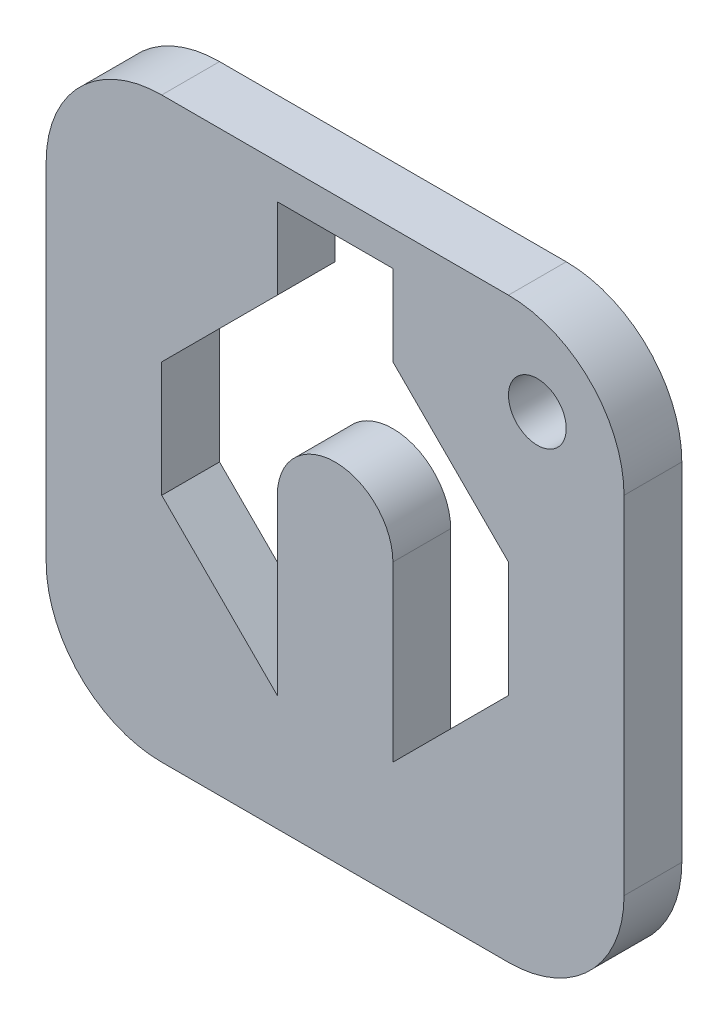
ISO-10303-21;
HEADER;
FILE_DESCRIPTION(('STEP AP214'),'2;1');
FILE_NAME('part.step','',(''),(''),'','','');
FILE_SCHEMA(('AUTOMOTIVE_DESIGN { 1 0 10303 214 1 1 1 1 }'));
ENDSEC;
DATA;
#1=APPLICATION_CONTEXT('core data for automotive mechanical design processes');
#2=APPLICATION_PROTOCOL_DEFINITION('international standard','automotive_design',2000,#1);
#3=PRODUCT_CONTEXT('',#1,'mechanical');
#4=PRODUCT('Part','Part','',(#3));
#5=PRODUCT_RELATED_PRODUCT_CATEGORY('part','',(#4));
#6=PRODUCT_DEFINITION_FORMATION('','',#4);
#7=PRODUCT_DEFINITION_CONTEXT('part definition',#1,'design');
#8=PRODUCT_DEFINITION('design','',#6,#7);
#9=PRODUCT_DEFINITION_SHAPE('','',#8);
#10=(LENGTH_UNIT() NAMED_UNIT(*) SI_UNIT(.MILLI.,.METRE.));
#11=(NAMED_UNIT(*) PLANE_ANGLE_UNIT() SI_UNIT($,.RADIAN.));
#12=(NAMED_UNIT(*) SI_UNIT($,.STERADIAN.) SOLID_ANGLE_UNIT());
#13=UNCERTAINTY_MEASURE_WITH_UNIT(LENGTH_MEASURE(1.E-05),#10,'distance_accuracy_value','');
#14=(GEOMETRIC_REPRESENTATION_CONTEXT(3) GLOBAL_UNCERTAINTY_ASSIGNED_CONTEXT((#13)) GLOBAL_UNIT_ASSIGNED_CONTEXT((#10,
#11,#12)) REPRESENTATION_CONTEXT('',''));
#15=CARTESIAN_POINT('',(0.,0.,0.));
#16=DIRECTION('',(0.,0.,1.));
#17=DIRECTION('',(1.,0.,0.));
#18=AXIS2_PLACEMENT_3D('',#15,#16,#17);
#19=CARTESIAN_POINT('',(-25.,25.,5.));
#20=DIRECTION('',(1.,0.,0.));
#21=DIRECTION('',(0.,1.,0.));
#22=AXIS2_PLACEMENT_3D('',#19,#20,#21);
#23=PLANE('',#22);
#24=DIRECTION('',(0.,-1.,0.));
#25=VECTOR('',#24,1.);
#26=CARTESIAN_POINT('',(-25.,25.,5.));
#27=LINE('',#26,#25);
#28=CARTESIAN_POINT('',(-25.,15.,5.));
#29=VERTEX_POINT('',#28);
#30=CARTESIAN_POINT('',(-25.,-15.,5.));
#31=VERTEX_POINT('',#30);
#32=EDGE_CURVE('E277',#29,#31,#27,.T.);
#33=ORIENTED_EDGE('',*,*,#32,.F.);
#34=DIRECTION('',(0.,0.,-1.));
#35=VECTOR('',#34,1.);
#36=CARTESIAN_POINT('',(-25.,15.,5.));
#37=LINE('',#36,#35);
#38=CARTESIAN_POINT('',(-25.,15.,0.));
#39=VERTEX_POINT('',#38);
#40=EDGE_CURVE('E11',#29,#39,#37,.T.);
#41=ORIENTED_EDGE('',*,*,#40,.T.);
#42=DIRECTION('',(0.,-1.,0.));
#43=VECTOR('',#42,1.);
#44=CARTESIAN_POINT('',(-25.,25.,0.));
#45=LINE('',#44,#43);
#46=CARTESIAN_POINT('',(-25.,-15.,0.));
#47=VERTEX_POINT('',#46);
#48=EDGE_CURVE('E274',#39,#47,#45,.T.);
#49=ORIENTED_EDGE('',*,*,#48,.T.);
#50=DIRECTION('',(0.,0.,-1.));
#51=VECTOR('',#50,1.);
#52=CARTESIAN_POINT('',(-25.,-15.,5.));
#53=LINE('',#52,#51);
#54=EDGE_CURVE('E41',#47,#31,#53,.F.);
#55=ORIENTED_EDGE('',*,*,#54,.T.);
#56=EDGE_LOOP('',(#33,#41,#49,#55));
#57=FACE_BOUND('',#56,.T.);
#58=ADVANCED_FACE('F33',(#57),#23,.F.);
#59=CARTESIAN_POINT('',(-25.,-25.,5.));
#60=DIRECTION('',(0.,1.,0.));
#61=DIRECTION('',(0.,0.,1.));
#62=AXIS2_PLACEMENT_3D('',#59,#60,#61);
#63=PLANE('',#62);
#64=DIRECTION('',(1.,0.,0.));
#65=VECTOR('',#64,1.);
#66=CARTESIAN_POINT('',(-25.,-25.,0.));
#67=LINE('',#66,#65);
#68=CARTESIAN_POINT('',(-15.,-25.,0.));
#69=VERTEX_POINT('',#68);
#70=CARTESIAN_POINT('',(15.,-25.,0.));
#71=VERTEX_POINT('',#70);
#72=EDGE_CURVE('E293',#69,#71,#67,.T.);
#73=ORIENTED_EDGE('',*,*,#72,.T.);
#74=DIRECTION('',(0.,0.,-1.));
#75=VECTOR('',#74,1.);
#76=CARTESIAN_POINT('',(15.,-25.,5.));
#77=LINE('',#76,#75);
#78=CARTESIAN_POINT('',(15.,-25.,5.));
#79=VERTEX_POINT('',#78);
#80=EDGE_CURVE('E329',#71,#79,#77,.F.);
#81=ORIENTED_EDGE('',*,*,#80,.T.);
#82=DIRECTION('',(1.,0.,0.));
#83=VECTOR('',#82,1.);
#84=CARTESIAN_POINT('',(-25.,-25.,5.));
#85=LINE('',#84,#83);
#86=CARTESIAN_POINT('',(-15.,-25.,5.));
#87=VERTEX_POINT('',#86);
#88=EDGE_CURVE('E280',#87,#79,#85,.T.);
#89=ORIENTED_EDGE('',*,*,#88,.F.);
#90=DIRECTION('',(0.,0.,-1.));
#91=VECTOR('',#90,1.);
#92=CARTESIAN_POINT('',(-15.,-25.,5.));
#93=LINE('',#92,#91);
#94=EDGE_CURVE('E326',#87,#69,#93,.T.);
#95=ORIENTED_EDGE('',*,*,#94,.T.);
#96=EDGE_LOOP('',(#73,#81,#89,#95));
#97=FACE_BOUND('',#96,.T.);
#98=ADVANCED_FACE('F344',(#97),#63,.F.);
#99=CARTESIAN_POINT('',(25.,25.,5.));
#100=DIRECTION('',(-1.,0.,0.));
#101=DIRECTION('',(0.,-1.,0.));
#102=AXIS2_PLACEMENT_3D('',#99,#100,#101);
#103=PLANE('',#102);
#104=DIRECTION('',(0.,1.,0.));
#105=VECTOR('',#104,1.);
#106=CARTESIAN_POINT('',(25.,25.,0.));
#107=LINE('',#106,#105);
#108=CARTESIAN_POINT('',(25.,-15.,0.));
#109=VERTEX_POINT('',#108);
#110=CARTESIAN_POINT('',(25.,15.,0.));
#111=VERTEX_POINT('',#110);
#112=EDGE_CURVE('E296',#109,#111,#107,.T.);
#113=ORIENTED_EDGE('',*,*,#112,.T.);
#114=DIRECTION('',(0.,0.,-1.));
#115=VECTOR('',#114,1.);
#116=CARTESIAN_POINT('',(25.,15.,5.));
#117=LINE('',#116,#115);
#118=CARTESIAN_POINT('',(25.,15.,5.));
#119=VERTEX_POINT('',#118);
#120=EDGE_CURVE('E316',#111,#119,#117,.F.);
#121=ORIENTED_EDGE('',*,*,#120,.T.);
#122=DIRECTION('',(0.,1.,0.));
#123=VECTOR('',#122,1.);
#124=CARTESIAN_POINT('',(25.,25.,5.));
#125=LINE('',#124,#123);
#126=CARTESIAN_POINT('',(25.,-15.,5.));
#127=VERTEX_POINT('',#126);
#128=EDGE_CURVE('E284',#127,#119,#125,.T.);
#129=ORIENTED_EDGE('',*,*,#128,.F.);
#130=DIRECTION('',(0.,0.,-1.));
#131=VECTOR('',#130,1.);
#132=CARTESIAN_POINT('',(25.,-15.,5.));
#133=LINE('',#132,#131);
#134=EDGE_CURVE('E313',#127,#109,#133,.T.);
#135=ORIENTED_EDGE('',*,*,#134,.T.);
#136=EDGE_LOOP('',(#113,#121,#129,#135));
#137=FACE_BOUND('',#136,.T.);
#138=ADVANCED_FACE('F355',(#137),#103,.F.);
#139=CARTESIAN_POINT('',(-25.,25.,5.));
#140=DIRECTION('',(0.,-1.,0.));
#141=DIRECTION('',(0.,0.,-1.));
#142=AXIS2_PLACEMENT_3D('',#139,#140,#141);
#143=PLANE('',#142);
#144=DIRECTION('',(-1.,0.,0.));
#145=VECTOR('',#144,1.);
#146=CARTESIAN_POINT('',(-25.,25.,5.));
#147=LINE('',#146,#145);
#148=CARTESIAN_POINT('',(15.,25.,5.));
#149=VERTEX_POINT('',#148);
#150=CARTESIAN_POINT('',(-15.,25.,5.));
#151=VERTEX_POINT('',#150);
#152=EDGE_CURVE('E287',#149,#151,#147,.T.);
#153=ORIENTED_EDGE('',*,*,#152,.F.);
#154=DIRECTION('',(0.,0.,-1.));
#155=VECTOR('',#154,1.);
#156=CARTESIAN_POINT('',(15.,25.,5.));
#157=LINE('',#156,#155);
#158=CARTESIAN_POINT('',(15.,25.,0.));
#159=VERTEX_POINT('',#158);
#160=EDGE_CURVE('E302',#149,#159,#157,.T.);
#161=ORIENTED_EDGE('',*,*,#160,.T.);
#162=DIRECTION('',(-1.,0.,0.));
#163=VECTOR('',#162,1.);
#164=CARTESIAN_POINT('',(-25.,25.,0.));
#165=LINE('',#164,#163);
#166=CARTESIAN_POINT('',(-15.,25.,0.));
#167=VERTEX_POINT('',#166);
#168=EDGE_CURVE('E281',#159,#167,#165,.T.);
#169=ORIENTED_EDGE('',*,*,#168,.T.);
#170=DIRECTION('',(0.,0.,-1.));
#171=VECTOR('',#170,1.);
#172=CARTESIAN_POINT('',(-15.,25.,5.));
#173=LINE('',#172,#171);
#174=EDGE_CURVE('E290',#167,#151,#173,.F.);
#175=ORIENTED_EDGE('',*,*,#174,.T.);
#176=EDGE_LOOP('',(#153,#161,#169,#175));
#177=FACE_BOUND('',#176,.T.);
#178=ADVANCED_FACE('F363',(#177),#143,.F.);
#179=CARTESIAN_POINT('',(0.,0.,5.));
#180=DIRECTION('',(0.,0.,1.));
#181=DIRECTION('',(1.,0.,0.));
#182=AXIS2_PLACEMENT_3D('',#179,#180,#181);
#183=PLANE('',#182);
#184=CARTESIAN_POINT('',(0.,0.,5.));
#185=DIRECTION('',(0.,0.,-1.));
#186=DIRECTION('',(-1.,0.,0.));
#187=AXIS2_PLACEMENT_3D('',#184,#185,#186);
#188=CIRCLE('',#187,5.);
#189=CARTESIAN_POINT('',(-5.,0.,5.));
#190=VERTEX_POINT('',#189);
#191=CARTESIAN_POINT('',(5.,0.,5.));
#192=VERTEX_POINT('',#191);
#193=EDGE_CURVE('E48',#190,#192,#188,.T.);
#194=ORIENTED_EDGE('',*,*,#193,.F.);
#195=DIRECTION('',(0.,1.,0.));
#196=VECTOR('',#195,1.);
#197=CARTESIAN_POINT('',(-5.,0.,5.));
#198=LINE('',#197,#196);
#199=CARTESIAN_POINT('',(-5.,-15.,5.));
#200=VERTEX_POINT('',#199);
#201=EDGE_CURVE('E189',#200,#190,#198,.T.);
#202=ORIENTED_EDGE('',*,*,#201,.F.);
#203=DIRECTION('',(0.707106781186545,-0.70710678118655,0.));
#204=VECTOR('',#203,1.);
#205=CARTESIAN_POINT('',(-5.,-15.,5.));
#206=LINE('',#205,#204);
#207=CARTESIAN_POINT('',(-15.,-4.99999999999992,5.));
#208=VERTEX_POINT('',#207);
#209=EDGE_CURVE('E192',#208,#200,#206,.T.);
#210=ORIENTED_EDGE('',*,*,#209,.F.);
#211=DIRECTION('',(0.,-1.,0.));
#212=VECTOR('',#211,1.);
#213=CARTESIAN_POINT('',(-15.,-4.99999999999992,5.));
#214=LINE('',#213,#212);
#215=CARTESIAN_POINT('',(-15.,5.00000000000008,5.));
#216=VERTEX_POINT('',#215);
#217=EDGE_CURVE('E244',#216,#208,#214,.T.);
#218=ORIENTED_EDGE('',*,*,#217,.F.);
#219=DIRECTION('',(-0.70710678118655,-0.707106781186545,0.));
#220=VECTOR('',#219,1.);
#221=CARTESIAN_POINT('',(-15.,5.00000000000008,5.));
#222=LINE('',#221,#220);
#223=CARTESIAN_POINT('',(-4.99999999999992,15.0000000000001,5.));
#224=VERTEX_POINT('',#223);
#225=EDGE_CURVE('E241',#224,#216,#222,.T.);
#226=ORIENTED_EDGE('',*,*,#225,.F.);
#227=DIRECTION('',(0.,-1.,0.));
#228=VECTOR('',#227,1.);
#229=CARTESIAN_POINT('',(-4.99999999999992,15.0000000000001,5.));
#230=LINE('',#229,#228);
#231=CARTESIAN_POINT('',(-4.99999999999992,22.,5.));
#232=VERTEX_POINT('',#231);
#233=EDGE_CURVE('E238',#232,#224,#230,.T.);
#234=ORIENTED_EDGE('',*,*,#233,.F.);
#235=DIRECTION('',(-1.,0.,0.));
#236=VECTOR('',#235,1.);
#237=CARTESIAN_POINT('',(-4.99999999999992,22.,5.));
#238=LINE('',#237,#236);
#239=CARTESIAN_POINT('',(5.00000000000008,22.,5.));
#240=VERTEX_POINT('',#239);
#241=EDGE_CURVE('E235',#240,#232,#238,.T.);
#242=ORIENTED_EDGE('',*,*,#241,.F.);
#243=DIRECTION('',(0.,1.,0.));
#244=VECTOR('',#243,1.);
#245=CARTESIAN_POINT('',(5.00000000000008,22.,5.));
#246=LINE('',#245,#244);
#247=CARTESIAN_POINT('',(5.00000000000008,15.0000000000001,5.));
#248=VERTEX_POINT('',#247);
#249=EDGE_CURVE('E232',#248,#240,#246,.T.);
#250=ORIENTED_EDGE('',*,*,#249,.F.);
#251=DIRECTION('',(-0.707106781186545,0.70710678118655,0.));
#252=VECTOR('',#251,1.);
#253=CARTESIAN_POINT('',(5.00000000000008,15.0000000000001,5.));
#254=LINE('',#253,#252);
#255=CARTESIAN_POINT('',(15.,5.00000000000008,5.));
#256=VERTEX_POINT('',#255);
#257=EDGE_CURVE('E229',#256,#248,#254,.T.);
#258=ORIENTED_EDGE('',*,*,#257,.F.);
#259=DIRECTION('',(0.,1.,0.));
#260=VECTOR('',#259,1.);
#261=CARTESIAN_POINT('',(15.,5.00000000000008,5.));
#262=LINE('',#261,#260);
#263=CARTESIAN_POINT('',(15.,-5.00000000000006,5.));
#264=VERTEX_POINT('',#263);
#265=EDGE_CURVE('E226',#264,#256,#262,.T.);
#266=ORIENTED_EDGE('',*,*,#265,.F.);
#267=DIRECTION('',(0.70710678118655,0.707106781186545,0.));
#268=VECTOR('',#267,1.);
#269=CARTESIAN_POINT('',(15.,-5.00000000000006,5.));
#270=LINE('',#269,#268);
#271=CARTESIAN_POINT('',(5.,-15.,5.));
#272=VERTEX_POINT('',#271);
#273=EDGE_CURVE('E223',#272,#264,#270,.T.);
#274=ORIENTED_EDGE('',*,*,#273,.F.);
#275=DIRECTION('',(0.,-1.,0.));
#276=VECTOR('',#275,1.);
#277=CARTESIAN_POINT('',(5.,-15.,5.));
#278=LINE('',#277,#276);
#279=EDGE_CURVE('E221',#192,#272,#278,.T.);
#280=ORIENTED_EDGE('',*,*,#279,.F.);
#281=EDGE_LOOP('',(#194,#202,#210,#218,#226,#234,#242,#250,#258,#266,#274,#280));
#282=FACE_BOUND('',#281,.T.);
#283=CARTESIAN_POINT('',(17.5,17.5,5.));
#284=DIRECTION('',(0.,0.,1.));
#285=DIRECTION('',(1.,0.,0.));
#286=AXIS2_PLACEMENT_3D('',#283,#284,#285);
#287=CIRCLE('',#286,2.5);
#288=CARTESIAN_POINT('',(20.,17.5,5.));
#289=VERTEX_POINT('',#288);
#290=EDGE_CURVE('E251',#289,#289,#287,.T.);
#291=ORIENTED_EDGE('',*,*,#290,.F.);
#292=EDGE_LOOP('',(#291));
#293=FACE_BOUND('',#292,.T.);
#294=ORIENTED_EDGE('',*,*,#128,.T.);
#295=CARTESIAN_POINT('',(15.,15.,5.));
#296=DIRECTION('',(0.,0.,1.));
#297=DIRECTION('',(1.,0.,0.));
#298=AXIS2_PLACEMENT_3D('',#295,#296,#297);
#299=CIRCLE('',#298,9.99999999999997);
#300=EDGE_CURVE('E324',#119,#149,#299,.T.);
#301=ORIENTED_EDGE('',*,*,#300,.T.);
#302=ORIENTED_EDGE('',*,*,#152,.T.);
#303=CARTESIAN_POINT('',(-15.,15.,5.));
#304=DIRECTION('',(0.,0.,1.));
#305=DIRECTION('',(1.,0.,0.));
#306=AXIS2_PLACEMENT_3D('',#303,#304,#305);
#307=CIRCLE('',#306,9.99999999999997);
#308=EDGE_CURVE('E320',#151,#29,#307,.T.);
#309=ORIENTED_EDGE('',*,*,#308,.T.);
#310=ORIENTED_EDGE('',*,*,#32,.T.);
#311=CARTESIAN_POINT('',(-15.,-15.,5.));
#312=DIRECTION('',(0.,0.,1.));
#313=DIRECTION('',(1.,0.,0.));
#314=AXIS2_PLACEMENT_3D('',#311,#312,#313);
#315=CIRCLE('',#314,9.99999999999997);
#316=EDGE_CURVE('E318',#31,#87,#315,.T.);
#317=ORIENTED_EDGE('',*,*,#316,.T.);
#318=ORIENTED_EDGE('',*,*,#88,.T.);
#319=CARTESIAN_POINT('',(15.,-15.,5.));
#320=DIRECTION('',(0.,0.,1.));
#321=DIRECTION('',(1.,0.,0.));
#322=AXIS2_PLACEMENT_3D('',#319,#320,#321);
#323=CIRCLE('',#322,9.99999999999997);
#324=EDGE_CURVE('E322',#79,#127,#323,.T.);
#325=ORIENTED_EDGE('',*,*,#324,.T.);
#326=EDGE_LOOP('',(#294,#301,#302,#309,#310,#317,#318,#325));
#327=FACE_BOUND('',#326,.T.);
#328=ADVANCED_FACE('F338',(#282,#293,#327),#183,.T.);
#329=CARTESIAN_POINT('',(0.,0.,0.));
#330=DIRECTION('',(0.,0.,1.));
#331=DIRECTION('',(1.,0.,0.));
#332=AXIS2_PLACEMENT_3D('',#329,#330,#331);
#333=PLANE('',#332);
#334=DIRECTION('',(0.,1.,0.));
#335=VECTOR('',#334,1.);
#336=CARTESIAN_POINT('',(-5.,0.,0.));
#337=LINE('',#336,#335);
#338=CARTESIAN_POINT('',(-5.,-15.,0.));
#339=VERTEX_POINT('',#338);
#340=CARTESIAN_POINT('',(-5.,0.,0.));
#341=VERTEX_POINT('',#340);
#342=EDGE_CURVE('E178',#339,#341,#337,.T.);
#343=ORIENTED_EDGE('',*,*,#342,.T.);
#344=CARTESIAN_POINT('',(0.,0.,0.));
#345=DIRECTION('',(0.,0.,-1.));
#346=DIRECTION('',(-1.,0.,0.));
#347=AXIS2_PLACEMENT_3D('',#344,#345,#346);
#348=CIRCLE('',#347,5.);
#349=CARTESIAN_POINT('',(5.,0.,0.));
#350=VERTEX_POINT('',#349);
#351=EDGE_CURVE('E172',#341,#350,#348,.T.);
#352=ORIENTED_EDGE('',*,*,#351,.T.);
#353=DIRECTION('',(0.,-1.,0.));
#354=VECTOR('',#353,1.);
#355=CARTESIAN_POINT('',(5.,-15.,0.));
#356=LINE('',#355,#354);
#357=CARTESIAN_POINT('',(5.,-15.,0.));
#358=VERTEX_POINT('',#357);
#359=EDGE_CURVE('E181',#350,#358,#356,.T.);
#360=ORIENTED_EDGE('',*,*,#359,.T.);
#361=DIRECTION('',(0.70710678118655,0.707106781186545,0.));
#362=VECTOR('',#361,1.);
#363=CARTESIAN_POINT('',(15.,-5.00000000000006,0.));
#364=LINE('',#363,#362);
#365=CARTESIAN_POINT('',(15.,-5.00000000000006,0.));
#366=VERTEX_POINT('',#365);
#367=EDGE_CURVE('E56',#358,#366,#364,.T.);
#368=ORIENTED_EDGE('',*,*,#367,.T.);
#369=DIRECTION('',(0.,1.,0.));
#370=VECTOR('',#369,1.);
#371=CARTESIAN_POINT('',(15.,5.00000000000008,0.));
#372=LINE('',#371,#370);
#373=CARTESIAN_POINT('',(15.,5.00000000000008,0.));
#374=VERTEX_POINT('',#373);
#375=EDGE_CURVE('E196',#366,#374,#372,.T.);
#376=ORIENTED_EDGE('',*,*,#375,.T.);
#377=DIRECTION('',(-0.707106781186545,0.70710678118655,0.));
#378=VECTOR('',#377,1.);
#379=CARTESIAN_POINT('',(5.00000000000008,15.0000000000001,0.));
#380=LINE('',#379,#378);
#381=CARTESIAN_POINT('',(5.00000000000008,15.0000000000001,0.));
#382=VERTEX_POINT('',#381);
#383=EDGE_CURVE('E199',#374,#382,#380,.T.);
#384=ORIENTED_EDGE('',*,*,#383,.T.);
#385=DIRECTION('',(0.,1.,0.));
#386=VECTOR('',#385,1.);
#387=CARTESIAN_POINT('',(5.00000000000008,22.,0.));
#388=LINE('',#387,#386);
#389=CARTESIAN_POINT('',(5.00000000000008,22.,0.));
#390=VERTEX_POINT('',#389);
#391=EDGE_CURVE('E202',#382,#390,#388,.T.);
#392=ORIENTED_EDGE('',*,*,#391,.T.);
#393=DIRECTION('',(-1.,0.,0.));
#394=VECTOR('',#393,1.);
#395=CARTESIAN_POINT('',(-4.99999999999992,22.,0.));
#396=LINE('',#395,#394);
#397=CARTESIAN_POINT('',(-4.99999999999992,22.,0.));
#398=VERTEX_POINT('',#397);
#399=EDGE_CURVE('E205',#390,#398,#396,.T.);
#400=ORIENTED_EDGE('',*,*,#399,.T.);
#401=DIRECTION('',(0.,-1.,0.));
#402=VECTOR('',#401,1.);
#403=CARTESIAN_POINT('',(-4.99999999999992,15.0000000000001,0.));
#404=LINE('',#403,#402);
#405=CARTESIAN_POINT('',(-4.99999999999992,15.0000000000001,0.));
#406=VERTEX_POINT('',#405);
#407=EDGE_CURVE('E208',#398,#406,#404,.T.);
#408=ORIENTED_EDGE('',*,*,#407,.T.);
#409=DIRECTION('',(-0.70710678118655,-0.707106781186545,0.));
#410=VECTOR('',#409,1.);
#411=CARTESIAN_POINT('',(-15.,5.00000000000008,0.));
#412=LINE('',#411,#410);
#413=CARTESIAN_POINT('',(-15.,5.00000000000008,0.));
#414=VERTEX_POINT('',#413);
#415=EDGE_CURVE('E211',#406,#414,#412,.T.);
#416=ORIENTED_EDGE('',*,*,#415,.T.);
#417=DIRECTION('',(0.,-1.,0.));
#418=VECTOR('',#417,1.);
#419=CARTESIAN_POINT('',(-15.,-4.99999999999992,0.));
#420=LINE('',#419,#418);
#421=CARTESIAN_POINT('',(-15.,-4.99999999999992,0.));
#422=VERTEX_POINT('',#421);
#423=EDGE_CURVE('E214',#414,#422,#420,.T.);
#424=ORIENTED_EDGE('',*,*,#423,.T.);
#425=DIRECTION('',(0.707106781186545,-0.70710678118655,0.));
#426=VECTOR('',#425,1.);
#427=CARTESIAN_POINT('',(-5.,-15.,0.));
#428=LINE('',#427,#426);
#429=EDGE_CURVE('E217',#422,#339,#428,.T.);
#430=ORIENTED_EDGE('',*,*,#429,.T.);
#431=EDGE_LOOP('',(#343,#352,#360,#368,#376,#384,#392,#400,#408,#416,#424,#430));
#432=FACE_BOUND('',#431,.T.);
#433=CARTESIAN_POINT('',(17.5,17.5,0.));
#434=DIRECTION('',(0.,0.,1.));
#435=DIRECTION('',(1.,0.,0.));
#436=AXIS2_PLACEMENT_3D('',#433,#434,#435);
#437=CIRCLE('',#436,2.5);
#438=CARTESIAN_POINT('',(20.,17.5,0.));
#439=VERTEX_POINT('',#438);
#440=EDGE_CURVE('E271',#439,#439,#437,.T.);
#441=ORIENTED_EDGE('',*,*,#440,.T.);
#442=EDGE_LOOP('',(#441));
#443=FACE_BOUND('',#442,.T.);
#444=ORIENTED_EDGE('',*,*,#168,.F.);
#445=CARTESIAN_POINT('',(15.,15.,0.));
#446=DIRECTION('',(0.,0.,1.));
#447=DIRECTION('',(1.,0.,0.));
#448=AXIS2_PLACEMENT_3D('',#445,#446,#447);
#449=CIRCLE('',#448,9.99999999999997);
#450=EDGE_CURVE('E311',#159,#111,#449,.F.);
#451=ORIENTED_EDGE('',*,*,#450,.T.);
#452=ORIENTED_EDGE('',*,*,#112,.F.);
#453=CARTESIAN_POINT('',(15.,-15.,0.));
#454=DIRECTION('',(0.,0.,1.));
#455=DIRECTION('',(1.,0.,0.));
#456=AXIS2_PLACEMENT_3D('',#453,#454,#455);
#457=CIRCLE('',#456,9.99999999999997);
#458=EDGE_CURVE('E309',#109,#71,#457,.F.);
#459=ORIENTED_EDGE('',*,*,#458,.T.);
#460=ORIENTED_EDGE('',*,*,#72,.F.);
#461=CARTESIAN_POINT('',(-15.,-15.,0.));
#462=DIRECTION('',(0.,0.,1.));
#463=DIRECTION('',(1.,0.,0.));
#464=AXIS2_PLACEMENT_3D('',#461,#462,#463);
#465=CIRCLE('',#464,9.99999999999997);
#466=EDGE_CURVE('E305',#69,#47,#465,.F.);
#467=ORIENTED_EDGE('',*,*,#466,.T.);
#468=ORIENTED_EDGE('',*,*,#48,.F.);
#469=CARTESIAN_POINT('',(-15.,15.,0.));
#470=DIRECTION('',(0.,0.,1.));
#471=DIRECTION('',(1.,0.,0.));
#472=AXIS2_PLACEMENT_3D('',#469,#470,#471);
#473=CIRCLE('',#472,9.99999999999997);
#474=EDGE_CURVE('E307',#39,#167,#473,.F.);
#475=ORIENTED_EDGE('',*,*,#474,.T.);
#476=EDGE_LOOP('',(#444,#451,#452,#459,#460,#467,#468,#475));
#477=FACE_BOUND('',#476,.T.);
#478=ADVANCED_FACE('F185',(#432,#443,#477),#333,.F.);
#479=CARTESIAN_POINT('',(15.,15.,5.));
#480=DIRECTION('',(0.,0.,-1.));
#481=DIRECTION('',(-1.,0.,0.));
#482=AXIS2_PLACEMENT_3D('',#479,#480,#481);
#483=CYLINDRICAL_SURFACE('',#482,9.99999999999997);
#484=ORIENTED_EDGE('',*,*,#300,.F.);
#485=ORIENTED_EDGE('',*,*,#120,.F.);
#486=ORIENTED_EDGE('',*,*,#450,.F.);
#487=ORIENTED_EDGE('',*,*,#160,.F.);
#488=EDGE_LOOP('',(#484,#485,#486,#487));
#489=FACE_BOUND('',#488,.T.);
#490=ADVANCED_FACE('F361',(#489),#483,.T.);
#491=CARTESIAN_POINT('',(15.,-15.,5.));
#492=DIRECTION('',(0.,0.,-1.));
#493=DIRECTION('',(-1.,0.,0.));
#494=AXIS2_PLACEMENT_3D('',#491,#492,#493);
#495=CYLINDRICAL_SURFACE('',#494,9.99999999999997);
#496=ORIENTED_EDGE('',*,*,#324,.F.);
#497=ORIENTED_EDGE('',*,*,#80,.F.);
#498=ORIENTED_EDGE('',*,*,#458,.F.);
#499=ORIENTED_EDGE('',*,*,#134,.F.);
#500=EDGE_LOOP('',(#496,#497,#498,#499));
#501=FACE_BOUND('',#500,.T.);
#502=ADVANCED_FACE('F352',(#501),#495,.T.);
#503=CARTESIAN_POINT('',(-15.,15.,5.));
#504=DIRECTION('',(0.,0.,-1.));
#505=DIRECTION('',(-1.,0.,0.));
#506=AXIS2_PLACEMENT_3D('',#503,#504,#505);
#507=CYLINDRICAL_SURFACE('',#506,9.99999999999997);
#508=ORIENTED_EDGE('',*,*,#308,.F.);
#509=ORIENTED_EDGE('',*,*,#174,.F.);
#510=ORIENTED_EDGE('',*,*,#474,.F.);
#511=ORIENTED_EDGE('',*,*,#40,.F.);
#512=EDGE_LOOP('',(#508,#509,#510,#511));
#513=FACE_BOUND('',#512,.T.);
#514=ADVANCED_FACE('F366',(#513),#507,.T.);
#515=CARTESIAN_POINT('',(-15.,-15.,5.));
#516=DIRECTION('',(0.,0.,-1.));
#517=DIRECTION('',(-1.,0.,0.));
#518=AXIS2_PLACEMENT_3D('',#515,#516,#517);
#519=CYLINDRICAL_SURFACE('',#518,9.99999999999997);
#520=ORIENTED_EDGE('',*,*,#316,.F.);
#521=ORIENTED_EDGE('',*,*,#54,.F.);
#522=ORIENTED_EDGE('',*,*,#466,.F.);
#523=ORIENTED_EDGE('',*,*,#94,.F.);
#524=EDGE_LOOP('',(#520,#521,#522,#523));
#525=FACE_BOUND('',#524,.T.);
#526=ADVANCED_FACE('F35',(#525),#519,.T.);
#527=CARTESIAN_POINT('',(17.5,17.5,0.));
#528=DIRECTION('',(0.,0.,1.));
#529=DIRECTION('',(1.,0.,0.));
#530=AXIS2_PLACEMENT_3D('',#527,#528,#529);
#531=CYLINDRICAL_SURFACE('',#530,2.5);
#532=ORIENTED_EDGE('',*,*,#440,.F.);
#533=EDGE_LOOP('',(#532));
#534=FACE_BOUND('',#533,.T.);
#535=ORIENTED_EDGE('',*,*,#290,.T.);
#536=EDGE_LOOP('',(#535));
#537=FACE_BOUND('',#536,.T.);
#538=ADVANCED_FACE('F372',(#534,#537),#531,.F.);
#539=CARTESIAN_POINT('',(0.,0.,0.));
#540=DIRECTION('',(0.,0.,1.));
#541=DIRECTION('',(1.,0.,0.));
#542=AXIS2_PLACEMENT_3D('',#539,#540,#541);
#543=CYLINDRICAL_SURFACE('',#542,5.);
#544=ORIENTED_EDGE('',*,*,#193,.T.);
#545=DIRECTION('',(0.,0.,1.));
#546=VECTOR('',#545,1.);
#547=CARTESIAN_POINT('',(5.,0.,0.));
#548=LINE('',#547,#546);
#549=EDGE_CURVE('E168',#350,#192,#548,.T.);
#550=ORIENTED_EDGE('',*,*,#549,.F.);
#551=ORIENTED_EDGE('',*,*,#351,.F.);
#552=DIRECTION('',(0.,0.,1.));
#553=VECTOR('',#552,1.);
#554=CARTESIAN_POINT('',(-5.,0.,0.));
#555=LINE('',#554,#553);
#556=EDGE_CURVE('E249',#341,#190,#555,.T.);
#557=ORIENTED_EDGE('',*,*,#556,.T.);
#558=EDGE_LOOP('',(#544,#550,#551,#557));
#559=FACE_BOUND('',#558,.T.);
#560=ADVANCED_FACE('F170',(#559),#543,.T.);
#561=CARTESIAN_POINT('',(-5.,0.,0.));
#562=DIRECTION('',(1.,0.,0.));
#563=DIRECTION('',(0.,1.,0.));
#564=AXIS2_PLACEMENT_3D('',#561,#562,#563);
#565=PLANE('',#564);
#566=ORIENTED_EDGE('',*,*,#201,.T.);
#567=ORIENTED_EDGE('',*,*,#556,.F.);
#568=ORIENTED_EDGE('',*,*,#342,.F.);
#569=DIRECTION('',(0.,0.,1.));
#570=VECTOR('',#569,1.);
#571=CARTESIAN_POINT('',(-5.,-15.,0.));
#572=LINE('',#571,#570);
#573=EDGE_CURVE('E252',#339,#200,#572,.T.);
#574=ORIENTED_EDGE('',*,*,#573,.T.);
#575=EDGE_LOOP('',(#566,#567,#568,#574));
#576=FACE_BOUND('',#575,.T.);
#577=ADVANCED_FACE('F433',(#576),#565,.F.);
#578=CARTESIAN_POINT('',(-5.,-15.,0.));
#579=DIRECTION('',(-0.70710678118655,-0.707106781186545,0.));
#580=DIRECTION('',(0.707106781186545,-0.70710678118655,0.));
#581=AXIS2_PLACEMENT_3D('',#578,#579,#580);
#582=PLANE('',#581);
#583=ORIENTED_EDGE('',*,*,#209,.T.);
#584=ORIENTED_EDGE('',*,*,#573,.F.);
#585=ORIENTED_EDGE('',*,*,#429,.F.);
#586=DIRECTION('',(0.,0.,1.));
#587=VECTOR('',#586,1.);
#588=CARTESIAN_POINT('',(-15.,-4.99999999999992,0.));
#589=LINE('',#588,#587);
#590=EDGE_CURVE('E254',#422,#208,#589,.T.);
#591=ORIENTED_EDGE('',*,*,#590,.T.);
#592=EDGE_LOOP('',(#583,#584,#585,#591));
#593=FACE_BOUND('',#592,.T.);
#594=ADVANCED_FACE('F442',(#593),#582,.F.);
#595=CARTESIAN_POINT('',(-15.,-4.99999999999992,0.));
#596=DIRECTION('',(-1.,0.,0.));
#597=DIRECTION('',(0.,0.,1.));
#598=AXIS2_PLACEMENT_3D('',#595,#596,#597);
#599=PLANE('',#598);
#600=ORIENTED_EDGE('',*,*,#217,.T.);
#601=ORIENTED_EDGE('',*,*,#590,.F.);
#602=ORIENTED_EDGE('',*,*,#423,.F.);
#603=DIRECTION('',(0.,0.,1.));
#604=VECTOR('',#603,1.);
#605=CARTESIAN_POINT('',(-15.,5.00000000000008,0.));
#606=LINE('',#605,#604);
#607=EDGE_CURVE('E256',#414,#216,#606,.T.);
#608=ORIENTED_EDGE('',*,*,#607,.T.);
#609=EDGE_LOOP('',(#600,#601,#602,#608));
#610=FACE_BOUND('',#609,.T.);
#611=ADVANCED_FACE('F452',(#610),#599,.F.);
#612=CARTESIAN_POINT('',(-15.,5.00000000000008,0.));
#613=DIRECTION('',(-0.707106781186545,0.70710678118655,0.));
#614=DIRECTION('',(-0.70710678118655,-0.707106781186545,0.));
#615=AXIS2_PLACEMENT_3D('',#612,#613,#614);
#616=PLANE('',#615);
#617=ORIENTED_EDGE('',*,*,#225,.T.);
#618=ORIENTED_EDGE('',*,*,#607,.F.);
#619=ORIENTED_EDGE('',*,*,#415,.F.);
#620=DIRECTION('',(0.,0.,1.));
#621=VECTOR('',#620,1.);
#622=CARTESIAN_POINT('',(-4.99999999999992,15.0000000000001,0.));
#623=LINE('',#622,#621);
#624=EDGE_CURVE('E258',#406,#224,#623,.T.);
#625=ORIENTED_EDGE('',*,*,#624,.T.);
#626=EDGE_LOOP('',(#617,#618,#619,#625));
#627=FACE_BOUND('',#626,.T.);
#628=ADVANCED_FACE('F462',(#627),#616,.F.);
#629=CARTESIAN_POINT('',(-4.99999999999992,15.0000000000001,0.));
#630=DIRECTION('',(-1.,0.,0.));
#631=DIRECTION('',(0.,0.,1.));
#632=AXIS2_PLACEMENT_3D('',#629,#630,#631);
#633=PLANE('',#632);
#634=ORIENTED_EDGE('',*,*,#233,.T.);
#635=ORIENTED_EDGE('',*,*,#624,.F.);
#636=ORIENTED_EDGE('',*,*,#407,.F.);
#637=DIRECTION('',(0.,0.,1.));
#638=VECTOR('',#637,1.);
#639=CARTESIAN_POINT('',(-4.99999999999992,22.,0.));
#640=LINE('',#639,#638);
#641=EDGE_CURVE('E260',#398,#232,#640,.T.);
#642=ORIENTED_EDGE('',*,*,#641,.T.);
#643=EDGE_LOOP('',(#634,#635,#636,#642));
#644=FACE_BOUND('',#643,.T.);
#645=ADVANCED_FACE('F472',(#644),#633,.F.);
#646=CARTESIAN_POINT('',(-4.99999999999992,22.,0.));
#647=DIRECTION('',(0.,1.,0.));
#648=DIRECTION('',(0.,0.,1.));
#649=AXIS2_PLACEMENT_3D('',#646,#647,#648);
#650=PLANE('',#649);
#651=ORIENTED_EDGE('',*,*,#241,.T.);
#652=ORIENTED_EDGE('',*,*,#641,.F.);
#653=ORIENTED_EDGE('',*,*,#399,.F.);
#654=DIRECTION('',(0.,0.,1.));
#655=VECTOR('',#654,1.);
#656=CARTESIAN_POINT('',(5.00000000000008,22.,0.));
#657=LINE('',#656,#655);
#658=EDGE_CURVE('E262',#390,#240,#657,.T.);
#659=ORIENTED_EDGE('',*,*,#658,.T.);
#660=EDGE_LOOP('',(#651,#652,#653,#659));
#661=FACE_BOUND('',#660,.T.);
#662=ADVANCED_FACE('F482',(#661),#650,.F.);
#663=CARTESIAN_POINT('',(5.00000000000008,22.,0.));
#664=DIRECTION('',(1.,0.,0.));
#665=DIRECTION('',(0.,1.,0.));
#666=AXIS2_PLACEMENT_3D('',#663,#664,#665);
#667=PLANE('',#666);
#668=ORIENTED_EDGE('',*,*,#249,.T.);
#669=ORIENTED_EDGE('',*,*,#658,.F.);
#670=ORIENTED_EDGE('',*,*,#391,.F.);
#671=DIRECTION('',(0.,0.,1.));
#672=VECTOR('',#671,1.);
#673=CARTESIAN_POINT('',(5.00000000000008,15.0000000000001,0.));
#674=LINE('',#673,#672);
#675=EDGE_CURVE('E264',#382,#248,#674,.T.);
#676=ORIENTED_EDGE('',*,*,#675,.T.);
#677=EDGE_LOOP('',(#668,#669,#670,#676));
#678=FACE_BOUND('',#677,.T.);
#679=ADVANCED_FACE('F492',(#678),#667,.F.);
#680=CARTESIAN_POINT('',(5.00000000000008,15.0000000000001,0.));
#681=DIRECTION('',(0.70710678118655,0.707106781186545,0.));
#682=DIRECTION('',(-0.707106781186545,0.70710678118655,0.));
#683=AXIS2_PLACEMENT_3D('',#680,#681,#682);
#684=PLANE('',#683);
#685=ORIENTED_EDGE('',*,*,#257,.T.);
#686=ORIENTED_EDGE('',*,*,#675,.F.);
#687=ORIENTED_EDGE('',*,*,#383,.F.);
#688=DIRECTION('',(0.,0.,1.));
#689=VECTOR('',#688,1.);
#690=CARTESIAN_POINT('',(15.,5.00000000000008,0.));
#691=LINE('',#690,#689);
#692=EDGE_CURVE('E266',#374,#256,#691,.T.);
#693=ORIENTED_EDGE('',*,*,#692,.T.);
#694=EDGE_LOOP('',(#685,#686,#687,#693));
#695=FACE_BOUND('',#694,.T.);
#696=ADVANCED_FACE('F502',(#695),#684,.F.);
#697=CARTESIAN_POINT('',(15.,5.00000000000008,0.));
#698=DIRECTION('',(1.,0.,0.));
#699=DIRECTION('',(0.,1.,0.));
#700=AXIS2_PLACEMENT_3D('',#697,#698,#699);
#701=PLANE('',#700);
#702=ORIENTED_EDGE('',*,*,#265,.T.);
#703=ORIENTED_EDGE('',*,*,#692,.F.);
#704=ORIENTED_EDGE('',*,*,#375,.F.);
#705=DIRECTION('',(0.,0.,1.));
#706=VECTOR('',#705,1.);
#707=CARTESIAN_POINT('',(15.,-5.00000000000006,0.));
#708=LINE('',#707,#706);
#709=EDGE_CURVE('E268',#366,#264,#708,.T.);
#710=ORIENTED_EDGE('',*,*,#709,.T.);
#711=EDGE_LOOP('',(#702,#703,#704,#710));
#712=FACE_BOUND('',#711,.T.);
#713=ADVANCED_FACE('F512',(#712),#701,.F.);
#714=CARTESIAN_POINT('',(15.,-5.00000000000006,0.));
#715=DIRECTION('',(0.707106781186545,-0.70710678118655,0.));
#716=DIRECTION('',(0.70710678118655,0.707106781186545,0.));
#717=AXIS2_PLACEMENT_3D('',#714,#715,#716);
#718=PLANE('',#717);
#719=ORIENTED_EDGE('',*,*,#273,.T.);
#720=ORIENTED_EDGE('',*,*,#709,.F.);
#721=ORIENTED_EDGE('',*,*,#367,.F.);
#722=DIRECTION('',(0.,0.,1.));
#723=VECTOR('',#722,1.);
#724=CARTESIAN_POINT('',(5.,-15.,0.));
#725=LINE('',#724,#723);
#726=EDGE_CURVE('E177',#358,#272,#725,.T.);
#727=ORIENTED_EDGE('',*,*,#726,.T.);
#728=EDGE_LOOP('',(#719,#720,#721,#727));
#729=FACE_BOUND('',#728,.T.);
#730=ADVANCED_FACE('F522',(#729),#718,.F.);
#731=CARTESIAN_POINT('',(5.,-15.,0.));
#732=DIRECTION('',(-1.,0.,0.));
#733=DIRECTION('',(0.,-1.,0.));
#734=AXIS2_PLACEMENT_3D('',#731,#732,#733);
#735=PLANE('',#734);
#736=ORIENTED_EDGE('',*,*,#279,.T.);
#737=ORIENTED_EDGE('',*,*,#726,.F.);
#738=ORIENTED_EDGE('',*,*,#359,.F.);
#739=ORIENTED_EDGE('',*,*,#549,.T.);
#740=EDGE_LOOP('',(#736,#737,#738,#739));
#741=FACE_BOUND('',#740,.T.);
#742=ADVANCED_FACE('F182',(#741),#735,.F.);
#743=CLOSED_SHELL('',(#58,#98,#138,#178,#328,#478,#490,#502,#514,#526,#538,#560,#577,#594,#611,
#628,#645,#662,#679,#696,#713,#730,#742));
#744=MANIFOLD_SOLID_BREP('B2',#743);
#745=ADVANCED_BREP_SHAPE_REPRESENTATION('',(#18,#744),#14);
#746=SHAPE_DEFINITION_REPRESENTATION(#9,#745);
ENDSEC;
END-ISO-10303-21;
